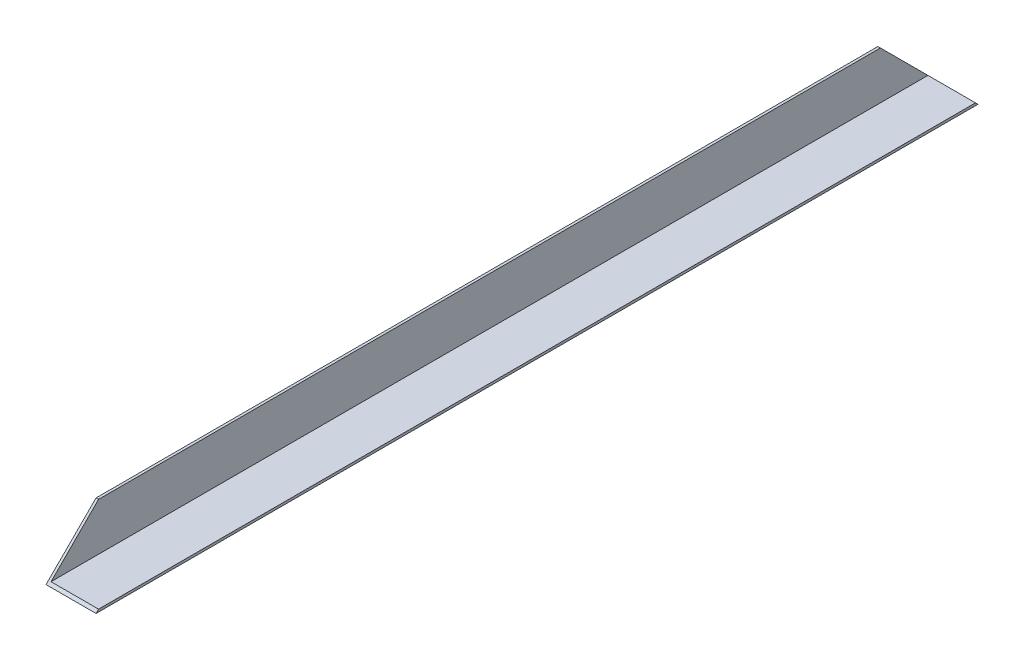
ISO-10303-21;
HEADER;
FILE_DESCRIPTION(('STEP AP214'),'2;1');
FILE_NAME('part.step','',(''),(''),'','','');
FILE_SCHEMA(('AUTOMOTIVE_DESIGN { 1 0 10303 214 1 1 1 1 }'));
ENDSEC;
DATA;
#1=APPLICATION_CONTEXT('core data for automotive mechanical design processes');
#2=APPLICATION_PROTOCOL_DEFINITION('international standard','automotive_design',2000,#1);
#3=PRODUCT_CONTEXT('',#1,'mechanical');
#4=PRODUCT('Part','Part','',(#3));
#5=PRODUCT_RELATED_PRODUCT_CATEGORY('part','',(#4));
#6=PRODUCT_DEFINITION_FORMATION('','',#4);
#7=PRODUCT_DEFINITION_CONTEXT('part definition',#1,'design');
#8=PRODUCT_DEFINITION('design','',#6,#7);
#9=PRODUCT_DEFINITION_SHAPE('','',#8);
#10=(LENGTH_UNIT() NAMED_UNIT(*) SI_UNIT(.MILLI.,.METRE.));
#11=(NAMED_UNIT(*) PLANE_ANGLE_UNIT() SI_UNIT($,.RADIAN.));
#12=(NAMED_UNIT(*) SI_UNIT($,.STERADIAN.) SOLID_ANGLE_UNIT());
#13=UNCERTAINTY_MEASURE_WITH_UNIT(LENGTH_MEASURE(1.E-05),#10,'distance_accuracy_value','');
#14=(GEOMETRIC_REPRESENTATION_CONTEXT(3) GLOBAL_UNCERTAINTY_ASSIGNED_CONTEXT((#13)) GLOBAL_UNIT_ASSIGNED_CONTEXT((#10,
#11,#12)) REPRESENTATION_CONTEXT('',''));
#15=CARTESIAN_POINT('',(0.,0.,0.));
#16=DIRECTION('',(0.,0.,1.));
#17=DIRECTION('',(1.,0.,0.));
#18=AXIS2_PLACEMENT_3D('',#15,#16,#17);
#19=CARTESIAN_POINT('',(0.,0.,-304.8));
#20=DIRECTION('',(0.,-1.,0.));
#21=DIRECTION('',(0.,0.,-1.));
#22=AXIS2_PLACEMENT_3D('',#19,#20,#21);
#23=PLANE('',#22);
#24=DIRECTION('',(-1.,0.,0.));
#25=VECTOR('',#24,1.);
#26=CARTESIAN_POINT('',(25.4,1.21103717278236E-13,-223.77));
#27=LINE('',#26,#25);
#28=CARTESIAN_POINT('',(25.4,1.21103717278236E-13,-223.77));
#29=VERTEX_POINT('',#28);
#30=CARTESIAN_POINT('',(0.,1.19538998711572E-13,-223.77));
#31=VERTEX_POINT('',#30);
#32=EDGE_CURVE('E84',#29,#31,#27,.T.);
#33=ORIENTED_EDGE('',*,*,#32,.F.);
#34=DIRECTION('',(0.,0.,1.));
#35=VECTOR('',#34,1.);
#36=CARTESIAN_POINT('',(25.4,0.,-304.8));
#37=LINE('',#36,#35);
#38=CARTESIAN_POINT('',(25.4,0.,223.77));
#39=VERTEX_POINT('',#38);
#40=EDGE_CURVE('E34',#29,#39,#37,.T.);
#41=ORIENTED_EDGE('',*,*,#40,.T.);
#42=DIRECTION('',(-1.,0.,0.));
#43=VECTOR('',#42,1.);
#44=CARTESIAN_POINT('',(25.4,1.21103717278236E-13,223.77));
#45=LINE('',#44,#43);
#46=CARTESIAN_POINT('',(0.,1.19538998711572E-13,223.77));
#47=VERTEX_POINT('',#46);
#48=EDGE_CURVE('E108',#39,#47,#45,.T.);
#49=ORIENTED_EDGE('',*,*,#48,.T.);
#50=DIRECTION('',(0.,0.,1.));
#51=VECTOR('',#50,1.);
#52=CARTESIAN_POINT('',(0.,0.,-304.8));
#53=LINE('',#52,#51);
#54=EDGE_CURVE('E11',#31,#47,#53,.T.);
#55=ORIENTED_EDGE('',*,*,#54,.F.);
#56=EDGE_LOOP('',(#33,#41,#49,#55));
#57=FACE_BOUND('',#56,.T.);
#58=ADVANCED_FACE('F31',(#57),#23,.T.);
#59=CARTESIAN_POINT('',(0.,25.4,-304.8));
#60=DIRECTION('',(-1.,0.,0.));
#61=DIRECTION('',(0.,-1.,0.));
#62=AXIS2_PLACEMENT_3D('',#59,#60,#61);
#63=PLANE('',#62);
#64=DIRECTION('',(0.,0.707106781186546,0.707106781186549));
#65=VECTOR('',#64,1.);
#66=CARTESIAN_POINT('',(0.,25.4,-198.37));
#67=LINE('',#66,#65);
#68=CARTESIAN_POINT('',(0.,25.4,-198.37));
#69=VERTEX_POINT('',#68);
#70=EDGE_CURVE('E88',#31,#69,#67,.T.);
#71=ORIENTED_EDGE('',*,*,#70,.F.);
#72=ORIENTED_EDGE('',*,*,#54,.T.);
#73=DIRECTION('',(0.,-0.707106781186546,0.707106781186549));
#74=VECTOR('',#73,1.);
#75=CARTESIAN_POINT('',(0.,1.19538998711572E-13,223.77));
#76=LINE('',#75,#74);
#77=CARTESIAN_POINT('',(0.,25.4,198.37));
#78=VERTEX_POINT('',#77);
#79=EDGE_CURVE('E133',#78,#47,#76,.T.);
#80=ORIENTED_EDGE('',*,*,#79,.F.);
#81=DIRECTION('',(0.,0.,1.));
#82=VECTOR('',#81,1.);
#83=CARTESIAN_POINT('',(0.,25.4,-304.8));
#84=LINE('',#83,#82);
#85=EDGE_CURVE('E39',#69,#78,#84,.T.);
#86=ORIENTED_EDGE('',*,*,#85,.F.);
#87=EDGE_LOOP('',(#71,#72,#80,#86));
#88=FACE_BOUND('',#87,.T.);
#89=ADVANCED_FACE('F141',(#88),#63,.T.);
#90=CARTESIAN_POINT('',(1.27,25.4,-304.8));
#91=DIRECTION('',(0.,1.,0.));
#92=DIRECTION('',(0.,0.,1.));
#93=AXIS2_PLACEMENT_3D('',#90,#91,#92);
#94=PLANE('',#93);
#95=DIRECTION('',(-1.,0.,0.));
#96=VECTOR('',#95,1.);
#97=CARTESIAN_POINT('',(25.4,25.4,-198.37));
#98=LINE('',#97,#96);
#99=CARTESIAN_POINT('',(1.27,25.4,-198.37));
#100=VERTEX_POINT('',#99);
#101=EDGE_CURVE('E91',#100,#69,#98,.T.);
#102=ORIENTED_EDGE('',*,*,#101,.T.);
#103=ORIENTED_EDGE('',*,*,#85,.T.);
#104=DIRECTION('',(-1.,0.,0.));
#105=VECTOR('',#104,1.);
#106=CARTESIAN_POINT('',(25.4,25.4,198.37));
#107=LINE('',#106,#105);
#108=CARTESIAN_POINT('',(1.27,25.4,198.37));
#109=VERTEX_POINT('',#108);
#110=EDGE_CURVE('E129',#109,#78,#107,.T.);
#111=ORIENTED_EDGE('',*,*,#110,.F.);
#112=DIRECTION('',(0.,0.,1.));
#113=VECTOR('',#112,1.);
#114=CARTESIAN_POINT('',(1.27,25.4,-304.8));
#115=LINE('',#114,#113);
#116=EDGE_CURVE('E113',#100,#109,#115,.T.);
#117=ORIENTED_EDGE('',*,*,#116,.F.);
#118=EDGE_LOOP('',(#102,#103,#111,#117));
#119=FACE_BOUND('',#118,.T.);
#120=ADVANCED_FACE('F127',(#119),#94,.T.);
#121=CARTESIAN_POINT('',(1.27,1.27,-304.8));
#122=DIRECTION('',(1.,0.,0.));
#123=DIRECTION('',(0.,1.,0.));
#124=AXIS2_PLACEMENT_3D('',#121,#122,#123);
#125=PLANE('',#124);
#126=DIRECTION('',(0.,-0.707106781186546,-0.707106781186549));
#127=VECTOR('',#126,1.);
#128=CARTESIAN_POINT('',(1.27,-39.88,-263.65));
#129=LINE('',#128,#127);
#130=CARTESIAN_POINT('',(1.27,1.27,-222.5));
#131=VERTEX_POINT('',#130);
#132=EDGE_CURVE('E124',#100,#131,#129,.T.);
#133=ORIENTED_EDGE('',*,*,#132,.F.);
#134=ORIENTED_EDGE('',*,*,#116,.T.);
#135=DIRECTION('',(0.,0.707106781186546,-0.707106781186549));
#136=VECTOR('',#135,1.);
#137=CARTESIAN_POINT('',(1.27,264.92,-41.1500000000012));
#138=LINE('',#137,#136);
#139=CARTESIAN_POINT('',(1.27,1.27,222.5));
#140=VERTEX_POINT('',#139);
#141=EDGE_CURVE('E98',#140,#109,#138,.T.);
#142=ORIENTED_EDGE('',*,*,#141,.F.);
#143=DIRECTION('',(0.,0.,1.));
#144=VECTOR('',#143,1.);
#145=CARTESIAN_POINT('',(1.27,1.27,-304.8));
#146=LINE('',#145,#144);
#147=EDGE_CURVE('E99',#131,#140,#146,.T.);
#148=ORIENTED_EDGE('',*,*,#147,.F.);
#149=EDGE_LOOP('',(#133,#134,#142,#148));
#150=FACE_BOUND('',#149,.T.);
#151=ADVANCED_FACE('F122',(#150),#125,.T.);
#152=CARTESIAN_POINT('',(25.4,1.27,-304.8));
#153=DIRECTION('',(0.,1.,0.));
#154=DIRECTION('',(-1.,0.,0.));
#155=AXIS2_PLACEMENT_3D('',#152,#153,#154);
#156=PLANE('',#155);
#157=DIRECTION('',(1.,0.,0.));
#158=VECTOR('',#157,1.);
#159=CARTESIAN_POINT('',(25.4,1.27,-222.5));
#160=LINE('',#159,#158);
#161=CARTESIAN_POINT('',(25.4,1.27,-222.5));
#162=VERTEX_POINT('',#161);
#163=EDGE_CURVE('E47',#131,#162,#160,.T.);
#164=ORIENTED_EDGE('',*,*,#163,.F.);
#165=ORIENTED_EDGE('',*,*,#147,.T.);
#166=DIRECTION('',(-1.,0.,0.));
#167=VECTOR('',#166,1.);
#168=CARTESIAN_POINT('',(25.4,1.27,222.5));
#169=LINE('',#168,#167);
#170=CARTESIAN_POINT('',(25.4,1.27000000000002,222.5));
#171=VERTEX_POINT('',#170);
#172=EDGE_CURVE('E101',#171,#140,#169,.T.);
#173=ORIENTED_EDGE('',*,*,#172,.F.);
#174=DIRECTION('',(0.,0.,1.));
#175=VECTOR('',#174,1.);
#176=CARTESIAN_POINT('',(25.4,1.27,-304.8));
#177=LINE('',#176,#175);
#178=EDGE_CURVE('E97',#162,#171,#177,.T.);
#179=ORIENTED_EDGE('',*,*,#178,.F.);
#180=EDGE_LOOP('',(#164,#165,#173,#179));
#181=FACE_BOUND('',#180,.T.);
#182=ADVANCED_FACE('F118',(#181),#156,.T.);
#183=CARTESIAN_POINT('',(25.4,0.,-304.8));
#184=DIRECTION('',(1.,0.,0.));
#185=DIRECTION('',(0.,0.,-1.));
#186=AXIS2_PLACEMENT_3D('',#183,#184,#185);
#187=PLANE('',#186);
#188=DIRECTION('',(0.,0.707106781186546,0.707106781186549));
#189=VECTOR('',#188,1.);
#190=CARTESIAN_POINT('',(25.4,25.4,-198.37));
#191=LINE('',#190,#189);
#192=EDGE_CURVE('E82',#29,#162,#191,.T.);
#193=ORIENTED_EDGE('',*,*,#192,.T.);
#194=ORIENTED_EDGE('',*,*,#178,.T.);
#195=DIRECTION('',(0.,-0.707106781186546,0.707106781186549));
#196=VECTOR('',#195,1.);
#197=CARTESIAN_POINT('',(25.4,1.21103717278236E-13,223.77));
#198=LINE('',#197,#196);
#199=EDGE_CURVE('E96',#171,#39,#198,.T.);
#200=ORIENTED_EDGE('',*,*,#199,.T.);
#201=ORIENTED_EDGE('',*,*,#40,.F.);
#202=EDGE_LOOP('',(#193,#194,#200,#201));
#203=FACE_BOUND('',#202,.T.);
#204=ADVANCED_FACE('F94',(#203),#187,.T.);
#205=CARTESIAN_POINT('',(25.4,1.21103717278236E-13,223.77));
#206=DIRECTION('',(0.,-0.707106781186549,-0.707106781186546));
#207=DIRECTION('',(0.,0.707106781186546,-0.707106781186549));
#208=AXIS2_PLACEMENT_3D('',#205,#206,#207);
#209=PLANE('',#208);
#210=ORIENTED_EDGE('',*,*,#141,.T.);
#211=ORIENTED_EDGE('',*,*,#110,.T.);
#212=ORIENTED_EDGE('',*,*,#79,.T.);
#213=ORIENTED_EDGE('',*,*,#48,.F.);
#214=ORIENTED_EDGE('',*,*,#199,.F.);
#215=ORIENTED_EDGE('',*,*,#172,.T.);
#216=EDGE_LOOP('',(#210,#211,#212,#213,#214,#215));
#217=FACE_BOUND('',#216,.T.);
#218=ADVANCED_FACE('F121',(#217),#209,.F.);
#219=CARTESIAN_POINT('',(25.4,25.4,-198.37));
#220=DIRECTION('',(0.,-0.707106781186549,0.707106781186546));
#221=DIRECTION('',(0.,-0.707106781186546,-0.707106781186549));
#222=AXIS2_PLACEMENT_3D('',#219,#220,#221);
#223=PLANE('',#222);
#224=ORIENTED_EDGE('',*,*,#132,.T.);
#225=ORIENTED_EDGE('',*,*,#163,.T.);
#226=ORIENTED_EDGE('',*,*,#192,.F.);
#227=ORIENTED_EDGE('',*,*,#32,.T.);
#228=ORIENTED_EDGE('',*,*,#70,.T.);
#229=ORIENTED_EDGE('',*,*,#101,.F.);
#230=EDGE_LOOP('',(#224,#225,#226,#227,#228,#229));
#231=FACE_BOUND('',#230,.T.);
#232=ADVANCED_FACE('F83',(#231),#223,.F.);
#233=CLOSED_SHELL('',(#58,#89,#120,#151,#182,#204,#218,#232));
#234=MANIFOLD_SOLID_BREP('B2',#233);
#235=ADVANCED_BREP_SHAPE_REPRESENTATION('',(#18,#234),#14);
#236=SHAPE_DEFINITION_REPRESENTATION(#9,#235);
ENDSEC;
END-ISO-10303-21;
